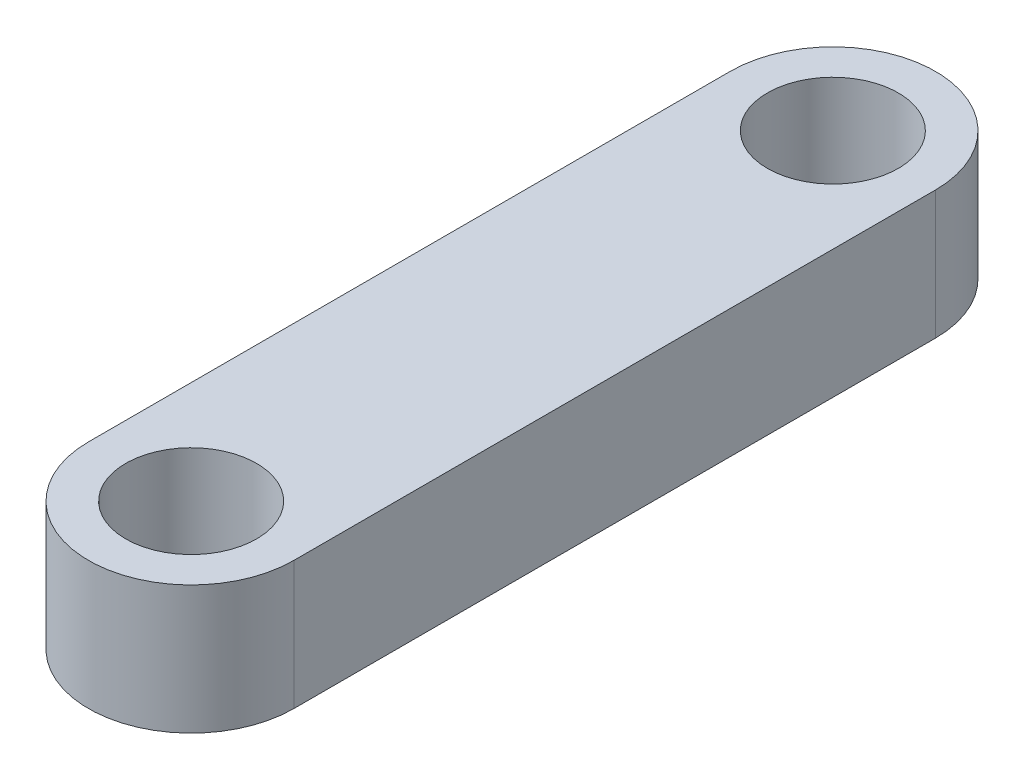
ISO-10303-21;
HEADER;
FILE_DESCRIPTION(('STEP AP214'),'2;1');
FILE_NAME('part.step','',(''),(''),'','','');
FILE_SCHEMA(('AUTOMOTIVE_DESIGN { 1 0 10303 214 1 1 1 1 }'));
ENDSEC;
DATA;
#1=APPLICATION_CONTEXT('core data for automotive mechanical design processes');
#2=APPLICATION_PROTOCOL_DEFINITION('international standard','automotive_design',2000,#1);
#3=PRODUCT_CONTEXT('',#1,'mechanical');
#4=PRODUCT('Part','Part','',(#3));
#5=PRODUCT_RELATED_PRODUCT_CATEGORY('part','',(#4));
#6=PRODUCT_DEFINITION_FORMATION('','',#4);
#7=PRODUCT_DEFINITION_CONTEXT('part definition',#1,'design');
#8=PRODUCT_DEFINITION('design','',#6,#7);
#9=PRODUCT_DEFINITION_SHAPE('','',#8);
#10=(LENGTH_UNIT() NAMED_UNIT(*) SI_UNIT(.MILLI.,.METRE.));
#11=(NAMED_UNIT(*) PLANE_ANGLE_UNIT() SI_UNIT($,.RADIAN.));
#12=(NAMED_UNIT(*) SI_UNIT($,.STERADIAN.) SOLID_ANGLE_UNIT());
#13=UNCERTAINTY_MEASURE_WITH_UNIT(LENGTH_MEASURE(1.E-05),#10,'distance_accuracy_value','');
#14=(GEOMETRIC_REPRESENTATION_CONTEXT(3) GLOBAL_UNCERTAINTY_ASSIGNED_CONTEXT((#13)) GLOBAL_UNIT_ASSIGNED_CONTEXT((#10,
#11,#12)) REPRESENTATION_CONTEXT('',''));
#15=CARTESIAN_POINT('',(0.,0.,0.));
#16=DIRECTION('',(0.,0.,1.));
#17=DIRECTION('',(1.,0.,0.));
#18=AXIS2_PLACEMENT_3D('',#15,#16,#17);
#19=CARTESIAN_POINT('',(0.,5.,-12.5));
#20=DIRECTION('',(0.,-1.,0.));
#21=DIRECTION('',(0.,0.,-1.));
#22=AXIS2_PLACEMENT_3D('',#19,#20,#21);
#23=CYLINDRICAL_SURFACE('',#22,3.99999999999999);
#24=CARTESIAN_POINT('',(0.,0.,-12.5));
#25=DIRECTION('',(0.,1.,0.));
#26=DIRECTION('',(0.,0.,1.));
#27=AXIS2_PLACEMENT_3D('',#24,#25,#26);
#28=CIRCLE('',#27,3.99999999999999);
#29=CARTESIAN_POINT('',(3.99999999999999,0.,-12.5));
#30=VERTEX_POINT('',#29);
#31=CARTESIAN_POINT('',(-3.99999999999999,0.,-12.5));
#32=VERTEX_POINT('',#31);
#33=EDGE_CURVE('E107',#30,#32,#28,.T.);
#34=ORIENTED_EDGE('',*,*,#33,.T.);
#35=DIRECTION('',(0.,-1.,0.));
#36=VECTOR('',#35,1.);
#37=CARTESIAN_POINT('',(-3.99999999999999,5.,-12.5));
#38=LINE('',#37,#36);
#39=CARTESIAN_POINT('',(-3.99999999999999,5.,-12.5));
#40=VERTEX_POINT('',#39);
#41=EDGE_CURVE('E11',#40,#32,#38,.T.);
#42=ORIENTED_EDGE('',*,*,#41,.F.);
#43=CARTESIAN_POINT('',(0.,5.,-12.5));
#44=DIRECTION('',(0.,1.,0.));
#45=DIRECTION('',(0.,0.,1.));
#46=AXIS2_PLACEMENT_3D('',#43,#44,#45);
#47=CIRCLE('',#46,3.99999999999999);
#48=CARTESIAN_POINT('',(3.99999999999999,5.,-12.5));
#49=VERTEX_POINT('',#48);
#50=EDGE_CURVE('E91',#49,#40,#47,.T.);
#51=ORIENTED_EDGE('',*,*,#50,.F.);
#52=DIRECTION('',(0.,-1.,0.));
#53=VECTOR('',#52,1.);
#54=CARTESIAN_POINT('',(3.99999999999999,5.,-12.5));
#55=LINE('',#54,#53);
#56=EDGE_CURVE('E103',#49,#30,#55,.T.);
#57=ORIENTED_EDGE('',*,*,#56,.T.);
#58=EDGE_LOOP('',(#34,#42,#51,#57));
#59=FACE_BOUND('',#58,.T.);
#60=ADVANCED_FACE('F39',(#59),#23,.T.);
#61=CARTESIAN_POINT('',(-3.99999999999999,5.,12.5));
#62=DIRECTION('',(1.,0.,0.));
#63=DIRECTION('',(0.,0.,-1.));
#64=AXIS2_PLACEMENT_3D('',#61,#62,#63);
#65=PLANE('',#64);
#66=DIRECTION('',(0.,0.,1.));
#67=VECTOR('',#66,1.);
#68=CARTESIAN_POINT('',(-3.99999999999999,0.,12.5));
#69=LINE('',#68,#67);
#70=CARTESIAN_POINT('',(-3.99999999999999,0.,12.5));
#71=VERTEX_POINT('',#70);
#72=EDGE_CURVE('E96',#32,#71,#69,.T.);
#73=ORIENTED_EDGE('',*,*,#72,.T.);
#74=DIRECTION('',(0.,-1.,0.));
#75=VECTOR('',#74,1.);
#76=CARTESIAN_POINT('',(-3.99999999999999,5.,12.5));
#77=LINE('',#76,#75);
#78=CARTESIAN_POINT('',(-3.99999999999999,5.,12.5));
#79=VERTEX_POINT('',#78);
#80=EDGE_CURVE('E48',#79,#71,#77,.T.);
#81=ORIENTED_EDGE('',*,*,#80,.F.);
#82=DIRECTION('',(0.,0.,1.));
#83=VECTOR('',#82,1.);
#84=CARTESIAN_POINT('',(-3.99999999999999,5.,12.5));
#85=LINE('',#84,#83);
#86=EDGE_CURVE('E86',#40,#79,#85,.T.);
#87=ORIENTED_EDGE('',*,*,#86,.F.);
#88=ORIENTED_EDGE('',*,*,#41,.T.);
#89=EDGE_LOOP('',(#73,#81,#87,#88));
#90=FACE_BOUND('',#89,.T.);
#91=ADVANCED_FACE('F95',(#90),#65,.F.);
#92=CARTESIAN_POINT('',(0.,5.,12.5));
#93=DIRECTION('',(0.,-1.,0.));
#94=DIRECTION('',(0.,0.,-1.));
#95=AXIS2_PLACEMENT_3D('',#92,#93,#94);
#96=CYLINDRICAL_SURFACE('',#95,3.99999999999999);
#97=CARTESIAN_POINT('',(0.,0.,12.5));
#98=DIRECTION('',(0.,1.,0.));
#99=DIRECTION('',(0.,0.,1.));
#100=AXIS2_PLACEMENT_3D('',#97,#98,#99);
#101=CIRCLE('',#100,3.99999999999999);
#102=CARTESIAN_POINT('',(3.99999999999999,0.,12.5));
#103=VERTEX_POINT('',#102);
#104=EDGE_CURVE('E73',#71,#103,#101,.T.);
#105=ORIENTED_EDGE('',*,*,#104,.T.);
#106=DIRECTION('',(0.,-1.,0.));
#107=VECTOR('',#106,1.);
#108=CARTESIAN_POINT('',(3.99999999999999,5.,12.5));
#109=LINE('',#108,#107);
#110=CARTESIAN_POINT('',(3.99999999999999,5.,12.5));
#111=VERTEX_POINT('',#110);
#112=EDGE_CURVE('E98',#111,#103,#109,.T.);
#113=ORIENTED_EDGE('',*,*,#112,.F.);
#114=CARTESIAN_POINT('',(0.,5.,12.5));
#115=DIRECTION('',(0.,1.,0.));
#116=DIRECTION('',(0.,0.,1.));
#117=AXIS2_PLACEMENT_3D('',#114,#115,#116);
#118=CIRCLE('',#117,3.99999999999999);
#119=EDGE_CURVE('E89',#79,#111,#118,.T.);
#120=ORIENTED_EDGE('',*,*,#119,.F.);
#121=ORIENTED_EDGE('',*,*,#80,.T.);
#122=EDGE_LOOP('',(#105,#113,#120,#121));
#123=FACE_BOUND('',#122,.T.);
#124=ADVANCED_FACE('F99',(#123),#96,.T.);
#125=CARTESIAN_POINT('',(3.99999999999999,5.,12.5));
#126=DIRECTION('',(-1.,0.,0.));
#127=DIRECTION('',(0.,0.,1.));
#128=AXIS2_PLACEMENT_3D('',#125,#126,#127);
#129=PLANE('',#128);
#130=DIRECTION('',(0.,0.,-1.));
#131=VECTOR('',#130,1.);
#132=CARTESIAN_POINT('',(3.99999999999999,0.,12.5));
#133=LINE('',#132,#131);
#134=EDGE_CURVE('E79',#103,#30,#133,.T.);
#135=ORIENTED_EDGE('',*,*,#134,.T.);
#136=ORIENTED_EDGE('',*,*,#56,.F.);
#137=DIRECTION('',(0.,0.,-1.));
#138=VECTOR('',#137,1.);
#139=CARTESIAN_POINT('',(3.99999999999999,5.,12.5));
#140=LINE('',#139,#138);
#141=EDGE_CURVE('E56',#111,#49,#140,.T.);
#142=ORIENTED_EDGE('',*,*,#141,.F.);
#143=ORIENTED_EDGE('',*,*,#112,.T.);
#144=EDGE_LOOP('',(#135,#136,#142,#143));
#145=FACE_BOUND('',#144,.T.);
#146=ADVANCED_FACE('F121',(#145),#129,.F.);
#147=CARTESIAN_POINT('',(0.,5.,-12.5));
#148=DIRECTION('',(0.,1.,0.));
#149=DIRECTION('',(0.,0.,1.));
#150=AXIS2_PLACEMENT_3D('',#147,#148,#149);
#151=PLANE('',#150);
#152=CARTESIAN_POINT('',(0.,5.,-12.5));
#153=DIRECTION('',(0.,1.,0.));
#154=DIRECTION('',(0.,0.,1.));
#155=AXIS2_PLACEMENT_3D('',#152,#153,#154);
#156=CIRCLE('',#155,2.55);
#157=CARTESIAN_POINT('',(0.,5.,-9.95));
#158=VERTEX_POINT('',#157);
#159=EDGE_CURVE('E136',#158,#158,#156,.T.);
#160=ORIENTED_EDGE('',*,*,#159,.F.);
#161=EDGE_LOOP('',(#160));
#162=FACE_BOUND('',#161,.T.);
#163=CARTESIAN_POINT('',(0.,5.,12.5));
#164=DIRECTION('',(0.,1.,0.));
#165=DIRECTION('',(0.,0.,1.));
#166=AXIS2_PLACEMENT_3D('',#163,#164,#165);
#167=CIRCLE('',#166,2.55);
#168=CARTESIAN_POINT('',(0.,5.,15.05));
#169=VERTEX_POINT('',#168);
#170=EDGE_CURVE('E128',#169,#169,#167,.T.);
#171=ORIENTED_EDGE('',*,*,#170,.F.);
#172=EDGE_LOOP('',(#171));
#173=FACE_BOUND('',#172,.T.);
#174=ORIENTED_EDGE('',*,*,#50,.T.);
#175=ORIENTED_EDGE('',*,*,#86,.T.);
#176=ORIENTED_EDGE('',*,*,#119,.T.);
#177=ORIENTED_EDGE('',*,*,#141,.T.);
#178=EDGE_LOOP('',(#174,#175,#176,#177));
#179=FACE_BOUND('',#178,.T.);
#180=ADVANCED_FACE('F87',(#162,#173,#179),#151,.T.);
#181=CARTESIAN_POINT('',(0.,0.,-12.5));
#182=DIRECTION('',(0.,1.,0.));
#183=DIRECTION('',(0.,0.,1.));
#184=AXIS2_PLACEMENT_3D('',#181,#182,#183);
#185=PLANE('',#184);
#186=CARTESIAN_POINT('',(0.,0.,-12.5));
#187=DIRECTION('',(0.,1.,0.));
#188=DIRECTION('',(0.,0.,1.));
#189=AXIS2_PLACEMENT_3D('',#186,#187,#188);
#190=CIRCLE('',#189,2.55);
#191=CARTESIAN_POINT('',(0.,0.,-9.95));
#192=VERTEX_POINT('',#191);
#193=EDGE_CURVE('E111',#192,#192,#190,.T.);
#194=ORIENTED_EDGE('',*,*,#193,.T.);
#195=EDGE_LOOP('',(#194));
#196=FACE_BOUND('',#195,.T.);
#197=CARTESIAN_POINT('',(0.,0.,12.5));
#198=DIRECTION('',(0.,1.,0.));
#199=DIRECTION('',(0.,0.,1.));
#200=AXIS2_PLACEMENT_3D('',#197,#198,#199);
#201=CIRCLE('',#200,2.55);
#202=CARTESIAN_POINT('',(0.,0.,15.05));
#203=VERTEX_POINT('',#202);
#204=EDGE_CURVE('E132',#203,#203,#201,.T.);
#205=ORIENTED_EDGE('',*,*,#204,.T.);
#206=EDGE_LOOP('',(#205));
#207=FACE_BOUND('',#206,.T.);
#208=ORIENTED_EDGE('',*,*,#33,.F.);
#209=ORIENTED_EDGE('',*,*,#134,.F.);
#210=ORIENTED_EDGE('',*,*,#104,.F.);
#211=ORIENTED_EDGE('',*,*,#72,.F.);
#212=EDGE_LOOP('',(#208,#209,#210,#211));
#213=FACE_BOUND('',#212,.T.);
#214=ADVANCED_FACE('F124',(#196,#207,#213),#185,.F.);
#215=CARTESIAN_POINT('',(0.,0.,12.5));
#216=DIRECTION('',(0.,1.,0.));
#217=DIRECTION('',(0.,0.,1.));
#218=AXIS2_PLACEMENT_3D('',#215,#216,#217);
#219=CYLINDRICAL_SURFACE('',#218,2.55);
#220=ORIENTED_EDGE('',*,*,#204,.F.);
#221=EDGE_LOOP('',(#220));
#222=FACE_BOUND('',#221,.T.);
#223=ORIENTED_EDGE('',*,*,#170,.T.);
#224=EDGE_LOOP('',(#223));
#225=FACE_BOUND('',#224,.T.);
#226=ADVANCED_FACE('F149',(#222,#225),#219,.F.);
#227=CARTESIAN_POINT('',(0.,0.,-12.5));
#228=DIRECTION('',(0.,1.,0.));
#229=DIRECTION('',(0.,0.,1.));
#230=AXIS2_PLACEMENT_3D('',#227,#228,#229);
#231=CYLINDRICAL_SURFACE('',#230,2.55);
#232=ORIENTED_EDGE('',*,*,#193,.F.);
#233=EDGE_LOOP('',(#232));
#234=FACE_BOUND('',#233,.T.);
#235=ORIENTED_EDGE('',*,*,#159,.T.);
#236=EDGE_LOOP('',(#235));
#237=FACE_BOUND('',#236,.T.);
#238=ADVANCED_FACE('F146',(#234,#237),#231,.F.);
#239=CLOSED_SHELL('',(#60,#91,#124,#146,#180,#214,#226,#238));
#240=MANIFOLD_SOLID_BREP('B2',#239);
#241=ADVANCED_BREP_SHAPE_REPRESENTATION('',(#18,#240),#14);
#242=SHAPE_DEFINITION_REPRESENTATION(#9,#241);
ENDSEC;
END-ISO-10303-21;
